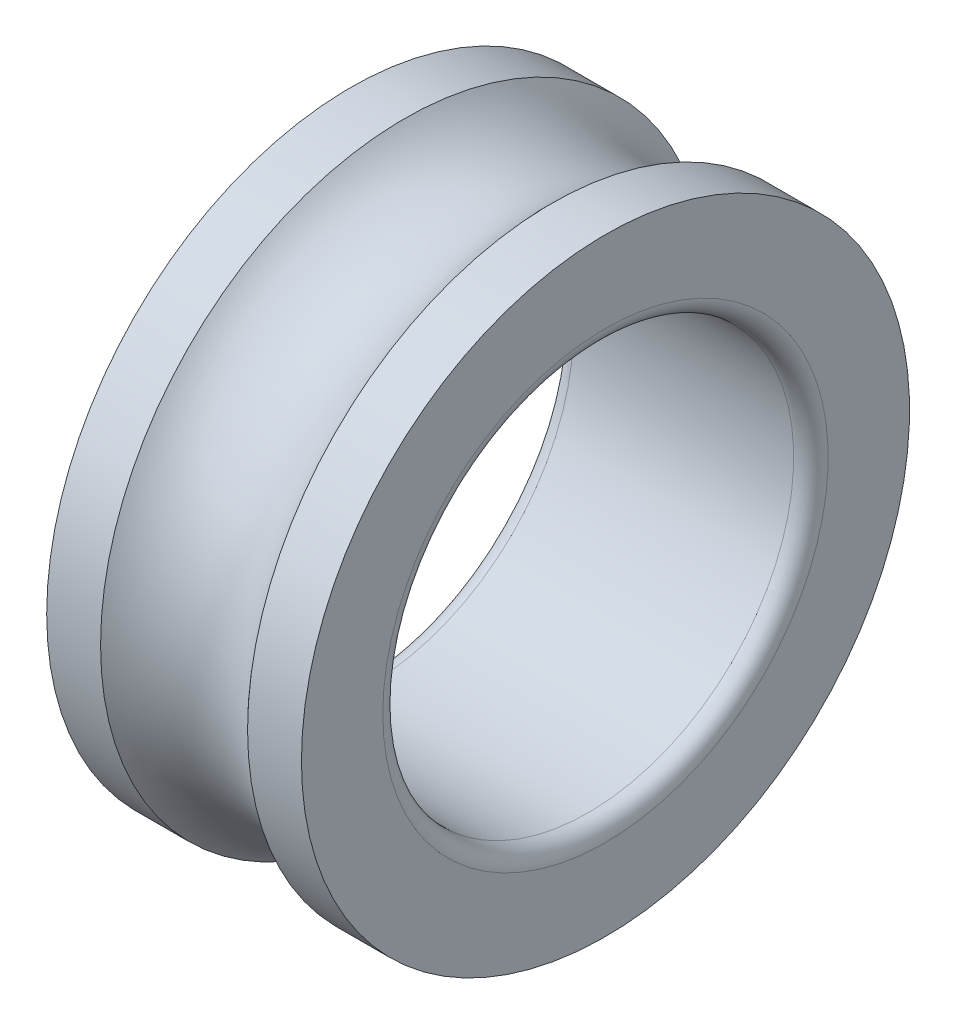
ISO-10303-21;
HEADER;
FILE_DESCRIPTION(('STEP AP214'),'2;1');
FILE_NAME('part.step','',(''),(''),'','','');
FILE_SCHEMA(('AUTOMOTIVE_DESIGN { 1 0 10303 214 1 1 1 1 }'));
ENDSEC;
DATA;
#1=APPLICATION_CONTEXT('core data for automotive mechanical design processes');
#2=APPLICATION_PROTOCOL_DEFINITION('international standard','automotive_design',2000,#1);
#3=PRODUCT_CONTEXT('',#1,'mechanical');
#4=PRODUCT('Part','Part','',(#3));
#5=PRODUCT_RELATED_PRODUCT_CATEGORY('part','',(#4));
#6=PRODUCT_DEFINITION_FORMATION('','',#4);
#7=PRODUCT_DEFINITION_CONTEXT('part definition',#1,'design');
#8=PRODUCT_DEFINITION('design','',#6,#7);
#9=PRODUCT_DEFINITION_SHAPE('','',#8);
#10=(LENGTH_UNIT() NAMED_UNIT(*) SI_UNIT(.MILLI.,.METRE.));
#11=(NAMED_UNIT(*) PLANE_ANGLE_UNIT() SI_UNIT($,.RADIAN.));
#12=(NAMED_UNIT(*) SI_UNIT($,.STERADIAN.) SOLID_ANGLE_UNIT());
#13=UNCERTAINTY_MEASURE_WITH_UNIT(LENGTH_MEASURE(1.E-05),#10,'distance_accuracy_value','');
#14=(GEOMETRIC_REPRESENTATION_CONTEXT(3) GLOBAL_UNCERTAINTY_ASSIGNED_CONTEXT((#13)) GLOBAL_UNIT_ASSIGNED_CONTEXT((#10,
#11,#12)) REPRESENTATION_CONTEXT('',''));
#15=CARTESIAN_POINT('',(0.,0.,0.));
#16=DIRECTION('',(0.,0.,1.));
#17=DIRECTION('',(1.,0.,0.));
#18=AXIS2_PLACEMENT_3D('',#15,#16,#17);
#19=CARTESIAN_POINT('',(-15.5,37.,0.));
#20=DIRECTION('',(1.,0.,0.));
#21=DIRECTION('',(0.,0.,-1.));
#22=AXIS2_PLACEMENT_3D('',#19,#20,#21);
#23=PLANE('',#22);
#24=CARTESIAN_POINT('',(-15.5,0.,0.));
#25=DIRECTION('',(-1.,0.,0.));
#26=DIRECTION('',(0.,0.,1.));
#27=AXIS2_PLACEMENT_3D('',#24,#25,#26);
#28=CIRCLE('',#27,27.1);
#29=CARTESIAN_POINT('',(-15.5,0.,27.1));
#30=VERTEX_POINT('',#29);
#31=EDGE_CURVE('E10',#30,#30,#28,.T.);
#32=ORIENTED_EDGE('',*,*,#31,.F.);
#33=EDGE_LOOP('',(#32));
#34=FACE_BOUND('',#33,.T.);
#35=CARTESIAN_POINT('',(-15.5,0.,0.));
#36=DIRECTION('',(-1.,0.,0.));
#37=DIRECTION('',(0.,0.,1.));
#38=AXIS2_PLACEMENT_3D('',#35,#36,#37);
#39=CIRCLE('',#38,37.);
#40=CARTESIAN_POINT('',(-15.5,0.,37.));
#41=VERTEX_POINT('',#40);
#42=EDGE_CURVE('E72',#41,#41,#39,.T.);
#43=ORIENTED_EDGE('',*,*,#42,.T.);
#44=EDGE_LOOP('',(#43));
#45=FACE_BOUND('',#44,.T.);
#46=ADVANCED_FACE('F37',(#34,#45),#23,.F.);
#47=CARTESIAN_POINT('',(-13.4,0.,0.));
#48=DIRECTION('',(-1.,0.,0.));
#49=DIRECTION('',(0.,0.,1.));
#50=AXIS2_PLACEMENT_3D('',#47,#48,#49);
#51=TOROIDAL_SURFACE('',#50,27.1,2.1);
#52=CARTESIAN_POINT('',(-13.4,0.,0.));
#53=DIRECTION('',(-1.,0.,0.));
#54=DIRECTION('',(0.,0.,1.));
#55=AXIS2_PLACEMENT_3D('',#52,#53,#54);
#56=CIRCLE('',#55,25.);
#57=CARTESIAN_POINT('',(-13.4,0.,25.));
#58=VERTEX_POINT('',#57);
#59=EDGE_CURVE('E44',#58,#58,#56,.T.);
#60=ORIENTED_EDGE('',*,*,#59,.F.);
#61=EDGE_LOOP('',(#60));
#62=FACE_BOUND('',#61,.T.);
#63=ORIENTED_EDGE('',*,*,#31,.T.);
#64=EDGE_LOOP('',(#63));
#65=FACE_BOUND('',#64,.T.);
#66=ADVANCED_FACE('F110',(#62,#65),#51,.T.);
#67=CARTESIAN_POINT('',(-12.261894953656,0.,0.));
#68=DIRECTION('',(-1.,0.,0.));
#69=DIRECTION('',(0.,0.,1.));
#70=AXIS2_PLACEMENT_3D('',#67,#68,#69);
#71=CYLINDRICAL_SURFACE('',#70,25.);
#72=CARTESIAN_POINT('',(13.4,0.,0.));
#73=DIRECTION('',(-1.,0.,0.));
#74=DIRECTION('',(0.,0.,1.));
#75=AXIS2_PLACEMENT_3D('',#72,#73,#74);
#76=CIRCLE('',#75,25.);
#77=CARTESIAN_POINT('',(13.4,0.,25.));
#78=VERTEX_POINT('',#77);
#79=EDGE_CURVE('E49',#78,#78,#76,.T.);
#80=ORIENTED_EDGE('',*,*,#79,.F.);
#81=EDGE_LOOP('',(#80));
#82=FACE_BOUND('',#81,.T.);
#83=ORIENTED_EDGE('',*,*,#59,.T.);
#84=EDGE_LOOP('',(#83));
#85=FACE_BOUND('',#84,.T.);
#86=ADVANCED_FACE('F105',(#82,#85),#71,.F.);
#87=CARTESIAN_POINT('',(13.4,0.,0.));
#88=DIRECTION('',(-1.,0.,0.));
#89=DIRECTION('',(0.,0.,1.));
#90=AXIS2_PLACEMENT_3D('',#87,#88,#89);
#91=TOROIDAL_SURFACE('',#90,27.1,2.1);
#92=CARTESIAN_POINT('',(15.5,0.,0.));
#93=DIRECTION('',(-1.,0.,0.));
#94=DIRECTION('',(0.,0.,1.));
#95=AXIS2_PLACEMENT_3D('',#92,#93,#94);
#96=CIRCLE('',#95,27.1);
#97=CARTESIAN_POINT('',(15.5,0.,27.1));
#98=VERTEX_POINT('',#97);
#99=EDGE_CURVE('E54',#98,#98,#96,.T.);
#100=ORIENTED_EDGE('',*,*,#99,.F.);
#101=EDGE_LOOP('',(#100));
#102=FACE_BOUND('',#101,.T.);
#103=ORIENTED_EDGE('',*,*,#79,.T.);
#104=EDGE_LOOP('',(#103));
#105=FACE_BOUND('',#104,.T.);
#106=ADVANCED_FACE('F99',(#102,#105),#91,.T.);
#107=CARTESIAN_POINT('',(15.5,37.,0.));
#108=DIRECTION('',(-1.,0.,0.));
#109=DIRECTION('',(0.,0.,1.));
#110=AXIS2_PLACEMENT_3D('',#107,#108,#109);
#111=PLANE('',#110);
#112=CARTESIAN_POINT('',(15.5,0.,0.));
#113=DIRECTION('',(-1.,0.,0.));
#114=DIRECTION('',(0.,0.,1.));
#115=AXIS2_PLACEMENT_3D('',#112,#113,#114);
#116=CIRCLE('',#115,37.);
#117=CARTESIAN_POINT('',(15.5,0.,37.));
#118=VERTEX_POINT('',#117);
#119=EDGE_CURVE('E60',#118,#118,#116,.T.);
#120=ORIENTED_EDGE('',*,*,#119,.F.);
#121=EDGE_LOOP('',(#120));
#122=FACE_BOUND('',#121,.T.);
#123=ORIENTED_EDGE('',*,*,#99,.T.);
#124=EDGE_LOOP('',(#123));
#125=FACE_BOUND('',#124,.T.);
#126=ADVANCED_FACE('F93',(#122,#125),#111,.F.);
#127=CARTESIAN_POINT('',(-12.261894953656,0.,0.));
#128=DIRECTION('',(-1.,0.,0.));
#129=DIRECTION('',(0.,0.,1.));
#130=AXIS2_PLACEMENT_3D('',#127,#128,#129);
#131=CYLINDRICAL_SURFACE('',#130,37.);
#132=CARTESIAN_POINT('',(8.94427190999916,0.,0.));
#133=DIRECTION('',(-1.,0.,0.));
#134=DIRECTION('',(0.,0.,1.));
#135=AXIS2_PLACEMENT_3D('',#132,#133,#134);
#136=CIRCLE('',#135,37.);
#137=CARTESIAN_POINT('',(8.94427190999916,0.,37.));
#138=VERTEX_POINT('',#137);
#139=EDGE_CURVE('E64',#138,#138,#136,.T.);
#140=ORIENTED_EDGE('',*,*,#139,.F.);
#141=EDGE_LOOP('',(#140));
#142=FACE_BOUND('',#141,.T.);
#143=ORIENTED_EDGE('',*,*,#119,.T.);
#144=EDGE_LOOP('',(#143));
#145=FACE_BOUND('',#144,.T.);
#146=ADVANCED_FACE('F87',(#142,#145),#131,.T.);
#147=CARTESIAN_POINT('',(0.,0.,0.));
#148=DIRECTION('',(-1.,0.,0.));
#149=DIRECTION('',(0.,0.,1.));
#150=AXIS2_PLACEMENT_3D('',#147,#148,#149);
#151=TOROIDAL_SURFACE('',#150,45.,12.);
#152=CARTESIAN_POINT('',(-8.94427190999916,0.,0.));
#153=DIRECTION('',(-1.,0.,0.));
#154=DIRECTION('',(0.,0.,1.));
#155=AXIS2_PLACEMENT_3D('',#152,#153,#154);
#156=CIRCLE('',#155,37.);
#157=CARTESIAN_POINT('',(-8.94427190999916,0.,37.));
#158=VERTEX_POINT('',#157);
#159=EDGE_CURVE('E68',#158,#158,#156,.T.);
#160=ORIENTED_EDGE('',*,*,#159,.F.);
#161=EDGE_LOOP('',(#160));
#162=FACE_BOUND('',#161,.T.);
#163=ORIENTED_EDGE('',*,*,#139,.T.);
#164=EDGE_LOOP('',(#163));
#165=FACE_BOUND('',#164,.T.);
#166=ADVANCED_FACE('F81',(#162,#165),#151,.F.);
#167=CARTESIAN_POINT('',(-12.261894953656,0.,0.));
#168=DIRECTION('',(-1.,0.,0.));
#169=DIRECTION('',(0.,0.,1.));
#170=AXIS2_PLACEMENT_3D('',#167,#168,#169);
#171=CYLINDRICAL_SURFACE('',#170,37.);
#172=ORIENTED_EDGE('',*,*,#42,.F.);
#173=EDGE_LOOP('',(#172));
#174=FACE_BOUND('',#173,.T.);
#175=ORIENTED_EDGE('',*,*,#159,.T.);
#176=EDGE_LOOP('',(#175));
#177=FACE_BOUND('',#176,.T.);
#178=ADVANCED_FACE('F78',(#174,#177),#171,.T.);
#179=CLOSED_SHELL('',(#46,#66,#86,#106,#126,#146,#166,#178));
#180=MANIFOLD_SOLID_BREP('B2',#179);
#181=ADVANCED_BREP_SHAPE_REPRESENTATION('',(#18,#180),#14);
#182=SHAPE_DEFINITION_REPRESENTATION(#9,#181);
ENDSEC;
END-ISO-10303-21;
